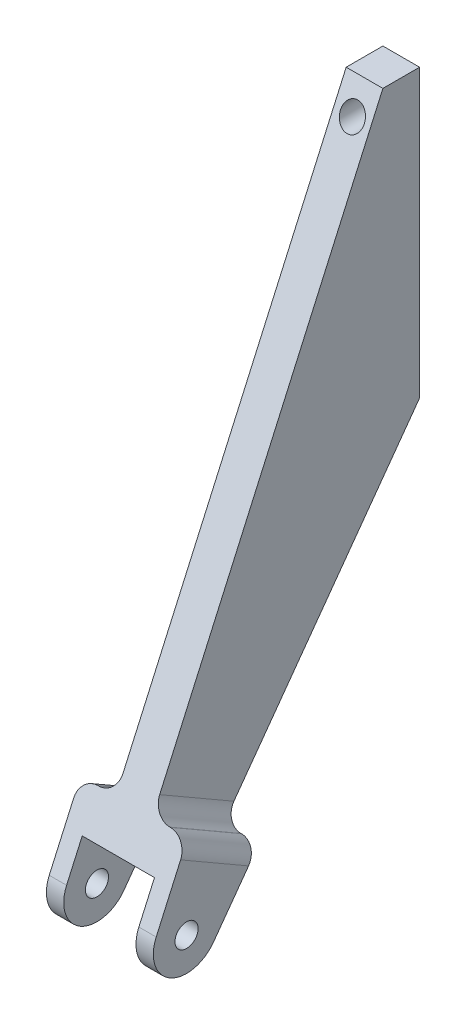
ISO-10303-21;
HEADER;
FILE_DESCRIPTION(('STEP AP214'),'2;1');
FILE_NAME('part.step','',(''),(''),'','','');
FILE_SCHEMA(('AUTOMOTIVE_DESIGN { 1 0 10303 214 1 1 1 1 }'));
ENDSEC;
DATA;
#1=APPLICATION_CONTEXT('core data for automotive mechanical design processes');
#2=APPLICATION_PROTOCOL_DEFINITION('international standard','automotive_design',2000,#1);
#3=PRODUCT_CONTEXT('',#1,'mechanical');
#4=PRODUCT('Part','Part','',(#3));
#5=PRODUCT_RELATED_PRODUCT_CATEGORY('part','',(#4));
#6=PRODUCT_DEFINITION_FORMATION('','',#4);
#7=PRODUCT_DEFINITION_CONTEXT('part definition',#1,'design');
#8=PRODUCT_DEFINITION('design','',#6,#7);
#9=PRODUCT_DEFINITION_SHAPE('','',#8);
#10=(LENGTH_UNIT() NAMED_UNIT(*) SI_UNIT(.MILLI.,.METRE.));
#11=(NAMED_UNIT(*) PLANE_ANGLE_UNIT() SI_UNIT($,.RADIAN.));
#12=(NAMED_UNIT(*) SI_UNIT($,.STERADIAN.) SOLID_ANGLE_UNIT());
#13=UNCERTAINTY_MEASURE_WITH_UNIT(LENGTH_MEASURE(1.E-05),#10,'distance_accuracy_value','');
#14=(GEOMETRIC_REPRESENTATION_CONTEXT(3) GLOBAL_UNCERTAINTY_ASSIGNED_CONTEXT((#13)) GLOBAL_UNIT_ASSIGNED_CONTEXT((#10,
#11,#12)) REPRESENTATION_CONTEXT('',''));
#15=CARTESIAN_POINT('',(0.,0.,0.));
#16=DIRECTION('',(0.,0.,1.));
#17=DIRECTION('',(1.,0.,0.));
#18=AXIS2_PLACEMENT_3D('',#15,#16,#17);
#19=CARTESIAN_POINT('',(-78.4084452466419,-210.483790761918,92.7733037843869));
#20=DIRECTION('',(1.,0.,0.));
#21=DIRECTION('',(0.,0.,-1.));
#22=AXIS2_PLACEMENT_3D('',#19,#20,#21);
#23=CYLINDRICAL_SURFACE('',#22,11.5);
#24=DIRECTION('',(1.,0.,0.));
#25=VECTOR('',#24,1.);
#26=CARTESIAN_POINT('',(-78.4084452466419,-205.796191727349,103.274561580056));
#27=LINE('',#26,#25);
#28=CARTESIAN_POINT('',(-59.558445246642,-205.796191727349,103.274561580056));
#29=VERTEX_POINT('',#28);
#30=CARTESIAN_POINT('',(-53.558445246642,-205.796191727349,103.274561580056));
#31=VERTEX_POINT('',#30);
#32=EDGE_CURVE('E286',#29,#31,#27,.T.);
#33=ORIENTED_EDGE('',*,*,#32,.F.);
#34=CARTESIAN_POINT('',(-59.558445246642,-210.483790761918,92.7733037843869));
#35=DIRECTION('',(-1.,0.,0.));
#36=DIRECTION('',(0.,0.,1.));
#37=AXIS2_PLACEMENT_3D('',#34,#35,#36);
#38=CIRCLE('',#37,11.5);
#39=CARTESIAN_POINT('',(-59.558445246642,-217.229583095587,83.4596425391511));
#40=VERTEX_POINT('',#39);
#41=EDGE_CURVE('E211',#29,#40,#38,.F.);
#42=ORIENTED_EDGE('',*,*,#41,.T.);
#43=DIRECTION('',(1.,0.,0.));
#44=VECTOR('',#43,1.);
#45=CARTESIAN_POINT('',(-78.4084452466419,-217.229583095587,83.4596425391511));
#46=LINE('',#45,#44);
#47=CARTESIAN_POINT('',(-53.558445246642,-217.229583095587,83.4596425391511));
#48=VERTEX_POINT('',#47);
#49=EDGE_CURVE('E208',#40,#48,#46,.T.);
#50=ORIENTED_EDGE('',*,*,#49,.T.);
#51=CARTESIAN_POINT('',(-53.558445246642,-210.483790761918,92.7733037843869));
#52=DIRECTION('',(1.,0.,0.));
#53=DIRECTION('',(0.,0.,-1.));
#54=AXIS2_PLACEMENT_3D('',#51,#52,#53);
#55=CIRCLE('',#54,11.5);
#56=EDGE_CURVE('E243',#31,#48,#55,.T.);
#57=ORIENTED_EDGE('',*,*,#56,.F.);
#58=EDGE_LOOP('',(#33,#42,#50,#57));
#59=FACE_BOUND('',#58,.T.);
#60=ADVANCED_FACE('F63',(#59),#23,.T.);
#61=CARTESIAN_POINT('',(-78.4084452466419,-210.483790761918,92.7733037843869));
#62=DIRECTION('',(1.,0.,0.));
#63=DIRECTION('',(0.,0.,-1.));
#64=AXIS2_PLACEMENT_3D('',#61,#62,#63);
#65=CYLINDRICAL_SURFACE('',#64,4.00000000000001);
#66=CARTESIAN_POINT('',(-53.558445246642,-210.483790761918,92.7733037843869));
#67=DIRECTION('',(1.,0.,0.));
#68=DIRECTION('',(0.,0.,-1.));
#69=AXIS2_PLACEMENT_3D('',#66,#67,#68);
#70=CIRCLE('',#69,4.00000000000001);
#71=CARTESIAN_POINT('',(-53.558445246642,-210.483790761918,88.7733037843869));
#72=VERTEX_POINT('',#71);
#73=EDGE_CURVE('E228',#72,#72,#70,.T.);
#74=ORIENTED_EDGE('',*,*,#73,.T.);
#75=EDGE_LOOP('',(#74));
#76=FACE_BOUND('',#75,.T.);
#77=CARTESIAN_POINT('',(-59.558445246642,-210.483790761918,92.7733037843869));
#78=DIRECTION('',(-1.,0.,0.));
#79=DIRECTION('',(0.,0.,1.));
#80=AXIS2_PLACEMENT_3D('',#77,#78,#79);
#81=CIRCLE('',#80,4.00000000000001);
#82=CARTESIAN_POINT('',(-59.558445246642,-210.483790761918,96.773303784387));
#83=VERTEX_POINT('',#82);
#84=EDGE_CURVE('E330',#83,#83,#81,.F.);
#85=ORIENTED_EDGE('',*,*,#84,.F.);
#86=EDGE_LOOP('',(#85));
#87=FACE_BOUND('',#86,.T.);
#88=ADVANCED_FACE('F447',(#76,#87),#65,.F.);
#89=CARTESIAN_POINT('',(-65.7084452466419,-322.212396424115,112.776));
#90=DIRECTION('',(-1.,0.,0.));
#91=DIRECTION('',(0.,0.,1.));
#92=AXIS2_PLACEMENT_3D('',#89,#90,#91);
#93=PLANE('',#92);
#94=DIRECTION('',(0.,-0.913152851797348,0.407617307353811));
#95=VECTOR('',#94,1.);
#96=CARTESIAN_POINT('',(-65.7084452466419,4.24711590624918,9.51447824157033));
#97=LINE('',#96,#95);
#98=CARTESIAN_POINT('',(-65.7084452466419,-2.88915683215951,12.7));
#99=VERTEX_POINT('',#98);
#100=CARTESIAN_POINT('',(-65.7084452466419,-175.878153334414,89.9196120477492));
#101=VERTEX_POINT('',#100);
#102=EDGE_CURVE('E287',#99,#101,#97,.T.);
#103=ORIENTED_EDGE('',*,*,#102,.T.);
#104=DIRECTION('',(0.,0.499778445707467,0.866153280433798));
#105=VECTOR('',#104,1.);
#106=CARTESIAN_POINT('',(-65.7084452466419,-190.383527582941,64.78071780933));
#107=LINE('',#106,#105);
#108=CARTESIAN_POINT('',(-65.7084452466419,-190.695002178179,64.2409091305958));
#109=VERTEX_POINT('',#108);
#110=EDGE_CURVE('E372',#101,#109,#107,.F.);
#111=ORIENTED_EDGE('',*,*,#110,.T.);
#112=DIRECTION('',(0.,-0.809883586542247,0.586590637710377));
#113=VECTOR('',#112,1.);
#114=CARTESIAN_POINT('',(-65.7084452466419,-35.0970347774457,-48.4571532091004));
#115=LINE('',#114,#113);
#116=CARTESIAN_POINT('',(-65.7084452466419,-102.,0.));
#117=VERTEX_POINT('',#116);
#118=EDGE_CURVE('E282',#117,#109,#115,.T.);
#119=ORIENTED_EDGE('',*,*,#118,.F.);
#120=DIRECTION('',(0.,1.,0.));
#121=VECTOR('',#120,1.);
#122=CARTESIAN_POINT('',(-65.7084452466419,-322.212396424115,0.));
#123=LINE('',#122,#121);
#124=CARTESIAN_POINT('',(-65.7084452466419,-2.88915683215951,0.));
#125=VERTEX_POINT('',#124);
#126=EDGE_CURVE('E297',#117,#125,#123,.T.);
#127=ORIENTED_EDGE('',*,*,#126,.T.);
#128=DIRECTION('',(0.,0.,-1.));
#129=VECTOR('',#128,1.);
#130=CARTESIAN_POINT('',(-65.7084452466419,-2.88915683215951,112.776));
#131=LINE('',#130,#129);
#132=EDGE_CURVE('E323',#99,#125,#131,.T.);
#133=ORIENTED_EDGE('',*,*,#132,.F.);
#134=EDGE_LOOP('',(#103,#111,#119,#127,#133));
#135=FACE_BOUND('',#134,.T.);
#136=ADVANCED_FACE('F391',(#135),#93,.F.);
#137=CARTESIAN_POINT('',(-78.4084452466419,-322.212396424115,112.776));
#138=DIRECTION('',(1.,0.,0.));
#139=DIRECTION('',(0.,0.,-1.));
#140=AXIS2_PLACEMENT_3D('',#137,#138,#139);
#141=PLANE('',#140);
#142=DIRECTION('',(0.,-0.809883586542247,0.586590637710377));
#143=VECTOR('',#142,1.);
#144=CARTESIAN_POINT('',(-78.4084452466419,-35.0970347774457,-48.4571532091004));
#145=LINE('',#144,#143);
#146=CARTESIAN_POINT('',(-78.4084452466419,-102.,0.));
#147=VERTEX_POINT('',#146);
#148=CARTESIAN_POINT('',(-78.4084452466419,-190.695002178179,64.2409091305958));
#149=VERTEX_POINT('',#148);
#150=EDGE_CURVE('E281',#147,#149,#145,.T.);
#151=ORIENTED_EDGE('',*,*,#150,.T.);
#152=DIRECTION('',(0.,-0.499778445707467,-0.866153280433798));
#153=VECTOR('',#152,1.);
#154=CARTESIAN_POINT('',(-78.4084452466419,-176.189627929652,89.3798033690149));
#155=LINE('',#154,#153);
#156=CARTESIAN_POINT('',(-78.4084452466419,-175.878153334414,89.9196120477492));
#157=VERTEX_POINT('',#156);
#158=EDGE_CURVE('E358',#149,#157,#155,.F.);
#159=ORIENTED_EDGE('',*,*,#158,.T.);
#160=DIRECTION('',(0.,-0.913152851797348,0.407617307353811));
#161=VECTOR('',#160,1.);
#162=CARTESIAN_POINT('',(-78.4084452466419,4.24711590624918,9.51447824157033));
#163=LINE('',#162,#161);
#164=CARTESIAN_POINT('',(-78.4084452466419,-2.88915683215951,12.7));
#165=VERTEX_POINT('',#164);
#166=EDGE_CURVE('E277',#165,#157,#163,.T.);
#167=ORIENTED_EDGE('',*,*,#166,.F.);
#168=DIRECTION('',(0.,0.,-1.));
#169=VECTOR('',#168,1.);
#170=CARTESIAN_POINT('',(-78.4084452466419,-2.88915683215951,112.776));
#171=LINE('',#170,#169);
#172=CARTESIAN_POINT('',(-78.4084452466419,-2.88915683215951,0.));
#173=VERTEX_POINT('',#172);
#174=EDGE_CURVE('E320',#165,#173,#171,.T.);
#175=ORIENTED_EDGE('',*,*,#174,.T.);
#176=DIRECTION('',(0.,-1.,0.));
#177=VECTOR('',#176,1.);
#178=CARTESIAN_POINT('',(-78.4084452466419,-322.212396424115,0.));
#179=LINE('',#178,#177);
#180=EDGE_CURVE('E316',#173,#147,#179,.T.);
#181=ORIENTED_EDGE('',*,*,#180,.T.);
#182=EDGE_LOOP('',(#151,#159,#167,#175,#181));
#183=FACE_BOUND('',#182,.T.);
#184=ADVANCED_FACE('F425',(#183),#141,.F.);
#185=CARTESIAN_POINT('',(-78.4084452466419,-2.88915683215951,112.776));
#186=DIRECTION('',(0.,-1.,0.));
#187=DIRECTION('',(0.,0.,-1.));
#188=AXIS2_PLACEMENT_3D('',#185,#186,#187);
#189=PLANE('',#188);
#190=DIRECTION('',(1.,0.,0.));
#191=VECTOR('',#190,1.);
#192=CARTESIAN_POINT('',(-78.4084452466419,-2.88915683215951,12.7));
#193=LINE('',#192,#191);
#194=EDGE_CURVE('E301',#165,#99,#193,.T.);
#195=ORIENTED_EDGE('',*,*,#194,.T.);
#196=ORIENTED_EDGE('',*,*,#132,.T.);
#197=DIRECTION('',(-1.,0.,0.));
#198=VECTOR('',#197,1.);
#199=CARTESIAN_POINT('',(-78.4084452466419,-2.88915683215951,0.));
#200=LINE('',#199,#198);
#201=EDGE_CURVE('E312',#125,#173,#200,.T.);
#202=ORIENTED_EDGE('',*,*,#201,.T.);
#203=ORIENTED_EDGE('',*,*,#174,.F.);
#204=EDGE_LOOP('',(#195,#196,#202,#203));
#205=FACE_BOUND('',#204,.T.);
#206=ADVANCED_FACE('F434',(#205),#189,.F.);
#207=CARTESIAN_POINT('',(0.,0.,0.));
#208=DIRECTION('',(0.,0.,-1.));
#209=DIRECTION('',(-1.,0.,0.));
#210=AXIS2_PLACEMENT_3D('',#207,#208,#209);
#211=PLANE('',#210);
#212=CARTESIAN_POINT('',(-72.,-12.4141568321594,0.));
#213=DIRECTION('',(0.,0.,-1.));
#214=DIRECTION('',(-1.,0.,0.));
#215=AXIS2_PLACEMENT_3D('',#212,#213,#214);
#216=CIRCLE('',#215,4.12750000000001);
#217=CARTESIAN_POINT('',(-76.1275,-12.4141568321594,0.));
#218=VERTEX_POINT('',#217);
#219=EDGE_CURVE('E265',#218,#218,#216,.T.);
#220=ORIENTED_EDGE('',*,*,#219,.F.);
#221=EDGE_LOOP('',(#220));
#222=FACE_BOUND('',#221,.T.);
#223=CARTESIAN_POINT('',(-72.,-91.7891568321594,0.));
#224=DIRECTION('',(0.,0.,-1.));
#225=DIRECTION('',(-1.,0.,0.));
#226=AXIS2_PLACEMENT_3D('',#223,#224,#225);
#227=CIRCLE('',#226,4.12750000000001);
#228=CARTESIAN_POINT('',(-76.1275,-91.7891568321594,0.));
#229=VERTEX_POINT('',#228);
#230=EDGE_CURVE('E264',#229,#229,#227,.T.);
#231=ORIENTED_EDGE('',*,*,#230,.F.);
#232=EDGE_LOOP('',(#231));
#233=FACE_BOUND('',#232,.T.);
#234=DIRECTION('',(1.,0.,0.));
#235=VECTOR('',#234,1.);
#236=CARTESIAN_POINT('',(-78.4084452466419,-102.,0.));
#237=LINE('',#236,#235);
#238=EDGE_CURVE('E298',#147,#117,#237,.T.);
#239=ORIENTED_EDGE('',*,*,#238,.F.);
#240=ORIENTED_EDGE('',*,*,#180,.F.);
#241=ORIENTED_EDGE('',*,*,#201,.F.);
#242=ORIENTED_EDGE('',*,*,#126,.F.);
#243=EDGE_LOOP('',(#239,#240,#241,#242));
#244=FACE_BOUND('',#243,.T.);
#245=ADVANCED_FACE('F431',(#222,#233,#244),#211,.T.);
#246=CARTESIAN_POINT('',(-84.558445246642,-210.483790761918,92.7733037843869));
#247=DIRECTION('',(-1.,0.,0.));
#248=DIRECTION('',(0.,0.,1.));
#249=AXIS2_PLACEMENT_3D('',#246,#247,#248);
#250=CIRCLE('',#249,11.5);
#251=CARTESIAN_POINT('',(-84.558445246642,-205.796191727349,103.274561580056));
#252=VERTEX_POINT('',#251);
#253=CARTESIAN_POINT('',(-84.558445246642,-217.229583095587,83.4596425391511));
#254=VERTEX_POINT('',#253);
#255=EDGE_CURVE('E223',#252,#254,#250,.F.);
#256=ORIENTED_EDGE('',*,*,#255,.F.);
#257=CARTESIAN_POINT('',(-90.558445246642,-205.796191727349,103.274561580056));
#258=VERTEX_POINT('',#257);
#259=EDGE_CURVE('E305',#258,#252,#27,.T.);
#260=ORIENTED_EDGE('',*,*,#259,.F.);
#261=CARTESIAN_POINT('',(-90.558445246642,-210.483790761918,92.7733037843869));
#262=DIRECTION('',(1.,0.,0.));
#263=DIRECTION('',(0.,0.,-1.));
#264=AXIS2_PLACEMENT_3D('',#261,#262,#263);
#265=CIRCLE('',#264,11.5);
#266=CARTESIAN_POINT('',(-90.558445246642,-217.229583095587,83.4596425391511));
#267=VERTEX_POINT('',#266);
#268=EDGE_CURVE('E240',#258,#267,#265,.T.);
#269=ORIENTED_EDGE('',*,*,#268,.T.);
#270=EDGE_CURVE('E293',#267,#254,#46,.T.);
#271=ORIENTED_EDGE('',*,*,#270,.T.);
#272=EDGE_LOOP('',(#256,#260,#269,#271));
#273=FACE_BOUND('',#272,.T.);
#274=ADVANCED_FACE('F441',(#273),#23,.T.);
#275=CARTESIAN_POINT('',(-78.4084452466419,-35.0970347774457,-48.4571532091004));
#276=DIRECTION('',(0.,0.586590637710377,0.809883586542247));
#277=DIRECTION('',(0.,-0.809883586542247,0.586590637710377));
#278=AXIS2_PLACEMENT_3D('',#275,#276,#277);
#279=PLANE('',#278);
#280=DIRECTION('',(0.,0.809883586542247,-0.586590637710377));
#281=VECTOR('',#280,1.);
#282=CARTESIAN_POINT('',(-90.558445246642,-217.229583095587,83.4596425391511));
#283=LINE('',#282,#281);
#284=CARTESIAN_POINT('',(-90.558445246642,-200.465892352909,71.3178678365538));
#285=VERTEX_POINT('',#284);
#286=EDGE_CURVE('E232',#267,#285,#283,.T.);
#287=ORIENTED_EDGE('',*,*,#286,.T.);
#288=CARTESIAN_POINT('',(-84.558445246642,-200.465892352909,71.3178678365538));
#289=DIRECTION('',(0.,0.586590637710377,0.809883586542247));
#290=DIRECTION('',(0.,-0.809883586542247,0.586590637710377));
#291=AXIS2_PLACEMENT_3D('',#288,#289,#290);
#292=ELLIPSE('',#291,6.03228064939915,6.);
#293=CARTESIAN_POINT('',(-84.558445246642,-195.580447265544,67.7793884835748));
#294=VERTEX_POINT('',#293);
#295=EDGE_CURVE('E355',#285,#294,#292,.F.);
#296=ORIENTED_EDGE('',*,*,#295,.T.);
#297=DIRECTION('',(-1.,0.,0.));
#298=VECTOR('',#297,1.);
#299=CARTESIAN_POINT('',(-53.558445246642,-195.580447265544,67.7793884835748));
#300=LINE('',#299,#298);
#301=CARTESIAN_POINT('',(-84.408445246642,-195.580447265544,67.7793884835748));
#302=VERTEX_POINT('',#301);
#303=EDGE_CURVE('E260',#302,#294,#300,.T.);
#304=ORIENTED_EDGE('',*,*,#303,.F.);
#305=CARTESIAN_POINT('',(-84.408445246642,-190.695002178179,64.2409091305958));
#306=DIRECTION('',(0.,0.586590637710377,0.809883586542247));
#307=DIRECTION('',(0.,-0.809883586542247,0.586590637710377));
#308=AXIS2_PLACEMENT_3D('',#305,#306,#307);
#309=ELLIPSE('',#308,6.03228064939915,6.);
#310=EDGE_CURVE('E375',#302,#149,#309,.T.);
#311=ORIENTED_EDGE('',*,*,#310,.T.);
#312=ORIENTED_EDGE('',*,*,#150,.F.);
#313=ORIENTED_EDGE('',*,*,#238,.T.);
#314=ORIENTED_EDGE('',*,*,#118,.T.);
#315=CARTESIAN_POINT('',(-59.708445246642,-190.695002178179,64.2409091305958));
#316=DIRECTION('',(0.,0.586590637710377,0.809883586542247));
#317=DIRECTION('',(0.,0.809883586542247,-0.586590637710377));
#318=AXIS2_PLACEMENT_3D('',#315,#316,#317);
#319=ELLIPSE('',#318,6.03228064939915,6.);
#320=CARTESIAN_POINT('',(-59.708445246642,-195.580447265544,67.7793884835748));
#321=VERTEX_POINT('',#320);
#322=EDGE_CURVE('E12',#109,#321,#319,.T.);
#323=ORIENTED_EDGE('',*,*,#322,.T.);
#324=CARTESIAN_POINT('',(-59.558445246642,-195.580447265544,67.7793884835748));
#325=VERTEX_POINT('',#324);
#326=EDGE_CURVE('E261',#325,#321,#300,.T.);
#327=ORIENTED_EDGE('',*,*,#326,.F.);
#328=CARTESIAN_POINT('',(-59.558445246642,-200.465892352909,71.3178678365538));
#329=DIRECTION('',(0.,0.586590637710377,0.809883586542247));
#330=DIRECTION('',(0.,0.809883586542247,-0.586590637710377));
#331=AXIS2_PLACEMENT_3D('',#328,#329,#330);
#332=ELLIPSE('',#331,6.03228064939915,6.);
#333=CARTESIAN_POINT('',(-53.558445246642,-200.465892352909,71.3178678365538));
#334=VERTEX_POINT('',#333);
#335=EDGE_CURVE('E79',#325,#334,#332,.F.);
#336=ORIENTED_EDGE('',*,*,#335,.T.);
#337=DIRECTION('',(0.,0.809883586542247,-0.586590637710377));
#338=VECTOR('',#337,1.);
#339=CARTESIAN_POINT('',(-53.558445246642,-217.229583095587,83.4596425391511));
#340=LINE('',#339,#338);
#341=EDGE_CURVE('E236',#48,#334,#340,.T.);
#342=ORIENTED_EDGE('',*,*,#341,.F.);
#343=ORIENTED_EDGE('',*,*,#49,.F.);
#344=DIRECTION('',(0.,-0.809883586542247,0.586590637710377));
#345=VECTOR('',#344,1.);
#346=CARTESIAN_POINT('',(-59.558445246642,-35.0970347774457,-48.4571532091004));
#347=LINE('',#346,#345);
#348=CARTESIAN_POINT('',(-59.558445246642,-206.491274627326,75.6819923718946));
#349=VERTEX_POINT('',#348);
#350=EDGE_CURVE('E199',#349,#40,#347,.T.);
#351=ORIENTED_EDGE('',*,*,#350,.F.);
#352=DIRECTION('',(-1.,0.,0.));
#353=VECTOR('',#352,1.);
#354=CARTESIAN_POINT('',(-78.4084452466419,-206.491274627326,75.6819923718947));
#355=LINE('',#354,#353);
#356=CARTESIAN_POINT('',(-84.558445246642,-206.491274627326,75.6819923718946));
#357=VERTEX_POINT('',#356);
#358=EDGE_CURVE('E184',#349,#357,#355,.T.);
#359=ORIENTED_EDGE('',*,*,#358,.T.);
#360=DIRECTION('',(0.,-0.809883586542247,0.586590637710377));
#361=VECTOR('',#360,1.);
#362=CARTESIAN_POINT('',(-84.558445246642,-35.0970347774457,-48.4571532091004));
#363=LINE('',#362,#361);
#364=EDGE_CURVE('E195',#357,#254,#363,.T.);
#365=ORIENTED_EDGE('',*,*,#364,.T.);
#366=ORIENTED_EDGE('',*,*,#270,.F.);
#367=EDGE_LOOP('',(#287,#296,#304,#311,#312,#313,#314,#323,#327,#336,#342,#343,#351,#359,#365,#366));
#368=FACE_BOUND('',#367,.T.);
#369=ADVANCED_FACE('F207',(#368),#279,.F.);
#370=CARTESIAN_POINT('',(-78.4084452466419,4.24711590624918,9.51447824157033));
#371=DIRECTION('',(0.,0.407617307353811,0.913152851797348));
#372=DIRECTION('',(0.,-0.913152851797348,0.407617307353811));
#373=AXIS2_PLACEMENT_3D('',#370,#371,#372);
#374=PLANE('',#373);
#375=DIRECTION('',(-1.,0.,0.));
#376=VECTOR('',#375,1.);
#377=CARTESIAN_POINT('',(-53.558445246642,-181.386547612255,92.3784740432597));
#378=LINE('',#377,#376);
#379=CARTESIAN_POINT('',(-84.408445246642,-181.386547612255,92.3784740432597));
#380=VERTEX_POINT('',#379);
#381=CARTESIAN_POINT('',(-84.558445246642,-181.386547612255,92.3784740432597));
#382=VERTEX_POINT('',#381);
#383=EDGE_CURVE('E247',#380,#382,#378,.T.);
#384=ORIENTED_EDGE('',*,*,#383,.T.);
#385=CARTESIAN_POINT('',(-84.558445246642,-186.894941890096,94.8373360387703));
#386=DIRECTION('',(0.,0.407617307353811,0.913152851797348));
#387=DIRECTION('',(0.,0.913152851797348,-0.407617307353811));
#388=AXIS2_PLACEMENT_3D('',#385,#386,#387);
#389=ELLIPSE('',#388,6.03228064939915,6.);
#390=CARTESIAN_POINT('',(-90.558445246642,-186.894941890096,94.8373360387703));
#391=VERTEX_POINT('',#390);
#392=EDGE_CURVE('E347',#382,#391,#389,.T.);
#393=ORIENTED_EDGE('',*,*,#392,.T.);
#394=DIRECTION('',(0.,-0.913152851797348,0.407617307353811));
#395=VECTOR('',#394,1.);
#396=CARTESIAN_POINT('',(-90.558445246642,-205.796191727349,103.274561580056));
#397=LINE('',#396,#395);
#398=EDGE_CURVE('E250',#391,#258,#397,.T.);
#399=ORIENTED_EDGE('',*,*,#398,.T.);
#400=ORIENTED_EDGE('',*,*,#259,.T.);
#401=DIRECTION('',(0.,-0.913152851797348,0.407617307353811));
#402=VECTOR('',#401,1.);
#403=CARTESIAN_POINT('',(-84.558445246642,4.24711590624918,9.51447824157033));
#404=LINE('',#403,#402);
#405=CARTESIAN_POINT('',(-84.558445246642,-193.6886281661,97.8699324999));
#406=VERTEX_POINT('',#405);
#407=EDGE_CURVE('E216',#406,#252,#404,.T.);
#408=ORIENTED_EDGE('',*,*,#407,.F.);
#409=DIRECTION('',(-1.,0.,0.));
#410=VECTOR('',#409,1.);
#411=CARTESIAN_POINT('',(-78.4084452466419,-193.6886281661,97.8699324999));
#412=LINE('',#411,#410);
#413=CARTESIAN_POINT('',(-59.558445246642,-193.6886281661,97.8699324999));
#414=VERTEX_POINT('',#413);
#415=EDGE_CURVE('E326',#414,#406,#412,.T.);
#416=ORIENTED_EDGE('',*,*,#415,.F.);
#417=DIRECTION('',(0.,-0.913152851797348,0.407617307353811));
#418=VECTOR('',#417,1.);
#419=CARTESIAN_POINT('',(-59.558445246642,4.24711590624918,9.51447824157033));
#420=LINE('',#419,#418);
#421=EDGE_CURVE('E202',#414,#29,#420,.T.);
#422=ORIENTED_EDGE('',*,*,#421,.T.);
#423=ORIENTED_EDGE('',*,*,#32,.T.);
#424=DIRECTION('',(0.,-0.913152851797348,0.407617307353811));
#425=VECTOR('',#424,1.);
#426=CARTESIAN_POINT('',(-53.558445246642,-205.796191727349,103.274561580056));
#427=LINE('',#426,#425);
#428=CARTESIAN_POINT('',(-53.558445246642,-186.894941890096,94.8373360387703));
#429=VERTEX_POINT('',#428);
#430=EDGE_CURVE('E239',#429,#31,#427,.T.);
#431=ORIENTED_EDGE('',*,*,#430,.F.);
#432=CARTESIAN_POINT('',(-59.558445246642,-186.894941890096,94.8373360387703));
#433=DIRECTION('',(0.,0.407617307353811,0.913152851797348));
#434=DIRECTION('',(0.,-0.913152851797348,0.407617307353811));
#435=AXIS2_PLACEMENT_3D('',#432,#433,#434);
#436=ELLIPSE('',#435,6.03228064939915,6.);
#437=CARTESIAN_POINT('',(-59.558445246642,-181.386547612255,92.3784740432597));
#438=VERTEX_POINT('',#437);
#439=EDGE_CURVE('E344',#429,#438,#436,.T.);
#440=ORIENTED_EDGE('',*,*,#439,.T.);
#441=CARTESIAN_POINT('',(-59.708445246642,-181.386547612255,92.3784740432597));
#442=VERTEX_POINT('',#441);
#443=EDGE_CURVE('E256',#438,#442,#378,.T.);
#444=ORIENTED_EDGE('',*,*,#443,.T.);
#445=CARTESIAN_POINT('',(-59.708445246642,-175.878153334414,89.9196120477491));
#446=DIRECTION('',(0.,0.407617307353811,0.913152851797348));
#447=DIRECTION('',(0.,-0.913152851797348,0.407617307353811));
#448=AXIS2_PLACEMENT_3D('',#445,#446,#447);
#449=ELLIPSE('',#448,6.03228064939915,6.);
#450=EDGE_CURVE('E72',#442,#101,#449,.F.);
#451=ORIENTED_EDGE('',*,*,#450,.T.);
#452=ORIENTED_EDGE('',*,*,#102,.F.);
#453=ORIENTED_EDGE('',*,*,#194,.F.);
#454=ORIENTED_EDGE('',*,*,#166,.T.);
#455=CARTESIAN_POINT('',(-84.408445246642,-175.878153334414,89.9196120477491));
#456=DIRECTION('',(0.,0.407617307353811,0.913152851797348));
#457=DIRECTION('',(0.,0.913152851797348,-0.407617307353811));
#458=AXIS2_PLACEMENT_3D('',#455,#456,#457);
#459=ELLIPSE('',#458,6.03228064939915,6.);
#460=EDGE_CURVE('E378',#157,#380,#459,.F.);
#461=ORIENTED_EDGE('',*,*,#460,.T.);
#462=EDGE_LOOP('',(#384,#393,#399,#400,#408,#416,#422,#423,#431,#440,#444,#451,#452,#453,#454,#461));
#463=FACE_BOUND('',#462,.T.);
#464=CARTESIAN_POINT('',(-72.,-12.4141568321594,16.9518126564496));
#465=DIRECTION('',(0.,0.407617307353811,0.913152851797348));
#466=DIRECTION('',(0.,0.913152851797348,-0.407617307353811));
#467=AXIS2_PLACEMENT_3D('',#464,#465,#466);
#468=ELLIPSE('',#467,4.52005378056467,4.12750000000001);
#469=CARTESIAN_POINT('',(-72.,-8.28665683215941,15.1093605053214));
#470=VERTEX_POINT('',#469);
#471=EDGE_CURVE('E269',#470,#470,#468,.T.);
#472=ORIENTED_EDGE('',*,*,#471,.F.);
#473=EDGE_LOOP('',(#472));
#474=FACE_BOUND('',#473,.T.);
#475=ADVANCED_FACE('F383',(#463,#474),#374,.T.);
#476=CARTESIAN_POINT('',(-72.,-12.4141568321594,25.4));
#477=DIRECTION('',(0.,0.,-1.));
#478=DIRECTION('',(-1.,0.,0.));
#479=AXIS2_PLACEMENT_3D('',#476,#477,#478);
#480=CYLINDRICAL_SURFACE('',#479,4.12750000000001);
#481=ORIENTED_EDGE('',*,*,#471,.T.);
#482=EDGE_LOOP('',(#481));
#483=FACE_BOUND('',#482,.T.);
#484=ORIENTED_EDGE('',*,*,#219,.T.);
#485=EDGE_LOOP('',(#484));
#486=FACE_BOUND('',#485,.T.);
#487=ADVANCED_FACE('F497',(#483,#486),#480,.F.);
#488=CARTESIAN_POINT('',(-72.,-91.7891568321594,25.4));
#489=DIRECTION('',(0.,0.,-1.));
#490=DIRECTION('',(-1.,0.,0.));
#491=AXIS2_PLACEMENT_3D('',#488,#489,#490);
#492=CYLINDRICAL_SURFACE('',#491,4.12750000000001);
#493=CARTESIAN_POINT('',(-72.,-91.7891568321594,25.4));
#494=DIRECTION('',(0.,0.,-1.));
#495=DIRECTION('',(-1.,0.,0.));
#496=AXIS2_PLACEMENT_3D('',#493,#494,#495);
#497=CIRCLE('',#496,4.12750000000001);
#498=CARTESIAN_POINT('',(-76.1275,-91.7891568321594,25.4));
#499=VERTEX_POINT('',#498);
#500=EDGE_CURVE('E270',#499,#499,#497,.T.);
#501=ORIENTED_EDGE('',*,*,#500,.F.);
#502=EDGE_LOOP('',(#501));
#503=FACE_BOUND('',#502,.T.);
#504=ORIENTED_EDGE('',*,*,#230,.T.);
#505=EDGE_LOOP('',(#504));
#506=FACE_BOUND('',#505,.T.);
#507=ADVANCED_FACE('F500',(#503,#506),#492,.F.);
#508=CARTESIAN_POINT('',(-72.,-91.7891568321594,25.4));
#509=DIRECTION('',(0.,0.,-1.));
#510=DIRECTION('',(-1.,0.,0.));
#511=AXIS2_PLACEMENT_3D('',#508,#509,#510);
#512=PLANE('',#511);
#513=ORIENTED_EDGE('',*,*,#500,.T.);
#514=EDGE_LOOP('',(#513));
#515=FACE_BOUND('',#514,.T.);
#516=ADVANCED_FACE('F502',(#515),#512,.T.);
#517=CARTESIAN_POINT('',(-53.558445246642,-195.580447265544,67.7793884835748));
#518=DIRECTION('',(0.,-0.866153280433798,0.499778445707467));
#519=DIRECTION('',(0.,-0.499778445707467,-0.866153280433798));
#520=AXIS2_PLACEMENT_3D('',#517,#518,#519);
#521=PLANE('',#520);
#522=ORIENTED_EDGE('',*,*,#303,.T.);
#523=DIRECTION('',(0.,0.499778445707467,0.866153280433798));
#524=VECTOR('',#523,1.);
#525=CARTESIAN_POINT('',(-84.558445246642,-195.580447265544,67.7793884835748));
#526=LINE('',#525,#524);
#527=EDGE_CURVE('E340',#294,#382,#526,.T.);
#528=ORIENTED_EDGE('',*,*,#527,.T.);
#529=ORIENTED_EDGE('',*,*,#383,.F.);
#530=DIRECTION('',(0.,-0.499778445707467,-0.866153280433798));
#531=VECTOR('',#530,1.);
#532=CARTESIAN_POINT('',(-84.408445246642,-195.580447265544,67.7793884835748));
#533=LINE('',#532,#531);
#534=EDGE_CURVE('E336',#380,#302,#533,.T.);
#535=ORIENTED_EDGE('',*,*,#534,.T.);
#536=EDGE_LOOP('',(#522,#528,#529,#535));
#537=FACE_BOUND('',#536,.T.);
#538=ADVANCED_FACE('F417',(#537),#521,.F.);
#539=CARTESIAN_POINT('',(-90.558445246642,-210.483790761918,92.7733037843869));
#540=DIRECTION('',(1.,0.,0.));
#541=DIRECTION('',(0.,0.,-1.));
#542=AXIS2_PLACEMENT_3D('',#539,#540,#541);
#543=PLANE('',#542);
#544=ORIENTED_EDGE('',*,*,#398,.F.);
#545=DIRECTION('',(0.,0.499778445707467,0.866153280433798));
#546=VECTOR('',#545,1.);
#547=CARTESIAN_POINT('',(-90.558445246642,-193.680417121502,83.0776019376621));
#548=LINE('',#547,#546);
#549=EDGE_CURVE('E350',#391,#285,#548,.F.);
#550=ORIENTED_EDGE('',*,*,#549,.T.);
#551=ORIENTED_EDGE('',*,*,#286,.F.);
#552=ORIENTED_EDGE('',*,*,#268,.F.);
#553=EDGE_LOOP('',(#544,#550,#551,#552));
#554=FACE_BOUND('',#553,.T.);
#555=CARTESIAN_POINT('',(-90.558445246642,-210.483790761918,92.7733037843869));
#556=DIRECTION('',(1.,0.,0.));
#557=DIRECTION('',(0.,0.,-1.));
#558=AXIS2_PLACEMENT_3D('',#555,#556,#557);
#559=CIRCLE('',#558,4.00000000000001);
#560=CARTESIAN_POINT('',(-90.558445246642,-210.483790761918,88.7733037843869));
#561=VERTEX_POINT('',#560);
#562=EDGE_CURVE('E194',#561,#561,#559,.T.);
#563=ORIENTED_EDGE('',*,*,#562,.T.);
#564=EDGE_LOOP('',(#563));
#565=FACE_BOUND('',#564,.T.);
#566=ADVANCED_FACE('F469',(#554,#565),#543,.F.);
#567=CARTESIAN_POINT('',(-84.558445246642,-210.483790761918,92.7733037843869));
#568=DIRECTION('',(-1.,0.,0.));
#569=DIRECTION('',(0.,0.,1.));
#570=AXIS2_PLACEMENT_3D('',#567,#568,#569);
#571=CIRCLE('',#570,4.00000000000001);
#572=CARTESIAN_POINT('',(-84.558445246642,-210.483790761918,96.773303784387));
#573=VERTEX_POINT('',#572);
#574=EDGE_CURVE('E210',#573,#573,#571,.F.);
#575=ORIENTED_EDGE('',*,*,#574,.T.);
#576=EDGE_LOOP('',(#575));
#577=FACE_BOUND('',#576,.T.);
#578=ORIENTED_EDGE('',*,*,#562,.F.);
#579=EDGE_LOOP('',(#578));
#580=FACE_BOUND('',#579,.T.);
#581=ADVANCED_FACE('F454',(#577,#580),#65,.F.);
#582=ORIENTED_EDGE('',*,*,#443,.F.);
#583=DIRECTION('',(0.,0.499778445707467,0.866153280433798));
#584=VECTOR('',#583,1.);
#585=CARTESIAN_POINT('',(-59.558445246642,-195.580447265544,67.7793884835748));
#586=LINE('',#585,#584);
#587=EDGE_CURVE('E369',#438,#325,#586,.F.);
#588=ORIENTED_EDGE('',*,*,#587,.T.);
#589=ORIENTED_EDGE('',*,*,#326,.T.);
#590=DIRECTION('',(0.,0.499778445707467,0.866153280433798));
#591=VECTOR('',#590,1.);
#592=CARTESIAN_POINT('',(-59.708445246642,-181.386547612255,92.3784740432597));
#593=LINE('',#592,#591);
#594=EDGE_CURVE('E365',#321,#442,#593,.T.);
#595=ORIENTED_EDGE('',*,*,#594,.T.);
#596=EDGE_LOOP('',(#582,#588,#589,#595));
#597=FACE_BOUND('',#596,.T.);
#598=ADVANCED_FACE('F394',(#597),#521,.F.);
#599=CARTESIAN_POINT('',(-53.558445246642,-210.483790761918,92.7733037843869));
#600=DIRECTION('',(1.,0.,0.));
#601=DIRECTION('',(0.,0.,-1.));
#602=AXIS2_PLACEMENT_3D('',#599,#600,#601);
#603=PLANE('',#602);
#604=ORIENTED_EDGE('',*,*,#341,.T.);
#605=DIRECTION('',(0.,0.499778445707467,0.866153280433798));
#606=VECTOR('',#605,1.);
#607=CARTESIAN_POINT('',(-53.558445246642,-186.583467294858,95.3771447175045));
#608=LINE('',#607,#606);
#609=EDGE_CURVE('E361',#334,#429,#608,.T.);
#610=ORIENTED_EDGE('',*,*,#609,.T.);
#611=ORIENTED_EDGE('',*,*,#430,.T.);
#612=ORIENTED_EDGE('',*,*,#56,.T.);
#613=EDGE_LOOP('',(#604,#610,#611,#612));
#614=FACE_BOUND('',#613,.T.);
#615=ORIENTED_EDGE('',*,*,#73,.F.);
#616=EDGE_LOOP('',(#615));
#617=FACE_BOUND('',#616,.T.);
#618=ADVANCED_FACE('F401',(#614,#617),#603,.T.);
#619=CARTESIAN_POINT('',(-84.558445246642,-190.796243790936,102.882650107754));
#620=DIRECTION('',(0.,0.866153280433798,-0.499778445707467));
#621=DIRECTION('',(0.,0.499778445707467,0.866153280433798));
#622=AXIS2_PLACEMENT_3D('',#619,#620,#621);
#623=PLANE('',#622);
#624=DIRECTION('',(0.,0.499778445707466,0.866153280433798));
#625=VECTOR('',#624,1.);
#626=CARTESIAN_POINT('',(-59.558445246642,-190.796243790936,102.882650107754));
#627=LINE('',#626,#625);
#628=EDGE_CURVE('E187',#349,#414,#627,.T.);
#629=ORIENTED_EDGE('',*,*,#628,.T.);
#630=ORIENTED_EDGE('',*,*,#415,.T.);
#631=DIRECTION('',(0.,0.499778445707466,0.866153280433798));
#632=VECTOR('',#631,1.);
#633=CARTESIAN_POINT('',(-84.558445246642,-190.796243790936,102.882650107754));
#634=LINE('',#633,#632);
#635=EDGE_CURVE('E190',#357,#406,#634,.T.);
#636=ORIENTED_EDGE('',*,*,#635,.F.);
#637=ORIENTED_EDGE('',*,*,#358,.F.);
#638=EDGE_LOOP('',(#629,#630,#636,#637));
#639=FACE_BOUND('',#638,.T.);
#640=ADVANCED_FACE('F186',(#639),#623,.F.);
#641=CARTESIAN_POINT('',(-84.558445246642,0.,0.));
#642=DIRECTION('',(-1.,0.,0.));
#643=DIRECTION('',(0.,0.,1.));
#644=AXIS2_PLACEMENT_3D('',#641,#642,#643);
#645=PLANE('',#644);
#646=ORIENTED_EDGE('',*,*,#574,.F.);
#647=EDGE_LOOP('',(#646));
#648=FACE_BOUND('',#647,.T.);
#649=ORIENTED_EDGE('',*,*,#635,.T.);
#650=ORIENTED_EDGE('',*,*,#407,.T.);
#651=ORIENTED_EDGE('',*,*,#255,.T.);
#652=ORIENTED_EDGE('',*,*,#364,.F.);
#653=EDGE_LOOP('',(#649,#650,#651,#652));
#654=FACE_BOUND('',#653,.T.);
#655=ADVANCED_FACE('F475',(#648,#654),#645,.F.);
#656=CARTESIAN_POINT('',(-59.558445246642,0.,0.));
#657=DIRECTION('',(-1.,0.,0.));
#658=DIRECTION('',(0.,0.,1.));
#659=AXIS2_PLACEMENT_3D('',#656,#657,#658);
#660=PLANE('',#659);
#661=ORIENTED_EDGE('',*,*,#84,.T.);
#662=EDGE_LOOP('',(#661));
#663=FACE_BOUND('',#662,.T.);
#664=ORIENTED_EDGE('',*,*,#350,.T.);
#665=ORIENTED_EDGE('',*,*,#41,.F.);
#666=ORIENTED_EDGE('',*,*,#421,.F.);
#667=ORIENTED_EDGE('',*,*,#628,.F.);
#668=EDGE_LOOP('',(#664,#665,#666,#667));
#669=FACE_BOUND('',#668,.T.);
#670=ADVANCED_FACE('F198',(#663,#669),#660,.T.);
#671=CARTESIAN_POINT('',(-84.558445246642,-200.777366948147,70.7780591578196));
#672=DIRECTION('',(0.,0.499778445707467,0.866153280433798));
#673=DIRECTION('',(0.,-0.866153280433798,0.499778445707467));
#674=AXIS2_PLACEMENT_3D('',#671,#672,#673);
#675=CYLINDRICAL_SURFACE('',#674,6.);
#676=ORIENTED_EDGE('',*,*,#295,.F.);
#677=ORIENTED_EDGE('',*,*,#549,.F.);
#678=ORIENTED_EDGE('',*,*,#392,.F.);
#679=ORIENTED_EDGE('',*,*,#527,.F.);
#680=EDGE_LOOP('',(#676,#677,#678,#679));
#681=FACE_BOUND('',#680,.T.);
#682=ADVANCED_FACE('F474',(#681),#675,.T.);
#683=CARTESIAN_POINT('',(-84.408445246642,-190.383527582941,64.78071780933));
#684=DIRECTION('',(0.,0.499778445707467,0.866153280433798));
#685=DIRECTION('',(0.,-0.866153280433798,0.499778445707467));
#686=AXIS2_PLACEMENT_3D('',#683,#684,#685);
#687=CYLINDRICAL_SURFACE('',#686,6.);
#688=ORIENTED_EDGE('',*,*,#460,.F.);
#689=ORIENTED_EDGE('',*,*,#158,.F.);
#690=ORIENTED_EDGE('',*,*,#310,.F.);
#691=ORIENTED_EDGE('',*,*,#534,.F.);
#692=EDGE_LOOP('',(#688,#689,#690,#691));
#693=FACE_BOUND('',#692,.T.);
#694=ADVANCED_FACE('F421',(#693),#687,.F.);
#695=CARTESIAN_POINT('',(-59.558445246642,-193.680417121502,83.0776019376621));
#696=DIRECTION('',(0.,-0.499778445707467,-0.866153280433798));
#697=DIRECTION('',(0.,0.866153280433798,-0.499778445707467));
#698=AXIS2_PLACEMENT_3D('',#695,#696,#697);
#699=CYLINDRICAL_SURFACE('',#698,6.);
#700=ORIENTED_EDGE('',*,*,#335,.F.);
#701=ORIENTED_EDGE('',*,*,#587,.F.);
#702=ORIENTED_EDGE('',*,*,#439,.F.);
#703=ORIENTED_EDGE('',*,*,#609,.F.);
#704=EDGE_LOOP('',(#700,#701,#702,#703));
#705=FACE_BOUND('',#704,.T.);
#706=ADVANCED_FACE('F398',(#705),#699,.T.);
#707=CARTESIAN_POINT('',(-59.708445246642,-190.383527582941,64.78071780933));
#708=DIRECTION('',(0.,-0.499778445707467,-0.866153280433798));
#709=DIRECTION('',(0.,0.866153280433798,-0.499778445707467));
#710=AXIS2_PLACEMENT_3D('',#707,#708,#709);
#711=CYLINDRICAL_SURFACE('',#710,6.);
#712=ORIENTED_EDGE('',*,*,#322,.F.);
#713=ORIENTED_EDGE('',*,*,#110,.F.);
#714=ORIENTED_EDGE('',*,*,#450,.F.);
#715=ORIENTED_EDGE('',*,*,#594,.F.);
#716=EDGE_LOOP('',(#712,#713,#714,#715));
#717=FACE_BOUND('',#716,.T.);
#718=ADVANCED_FACE('F65',(#717),#711,.F.);
#719=CLOSED_SHELL('',(#60,#88,#136,#184,#206,#245,#274,#369,#475,#487,#507,#516,#538,#566,#581,
#598,#618,#640,#655,#670,#682,#694,#706,#718));
#720=MANIFOLD_SOLID_BREP('B2',#719);
#721=ADVANCED_BREP_SHAPE_REPRESENTATION('',(#18,#720),#14);
#722=SHAPE_DEFINITION_REPRESENTATION(#9,#721);
ENDSEC;
END-ISO-10303-21;
